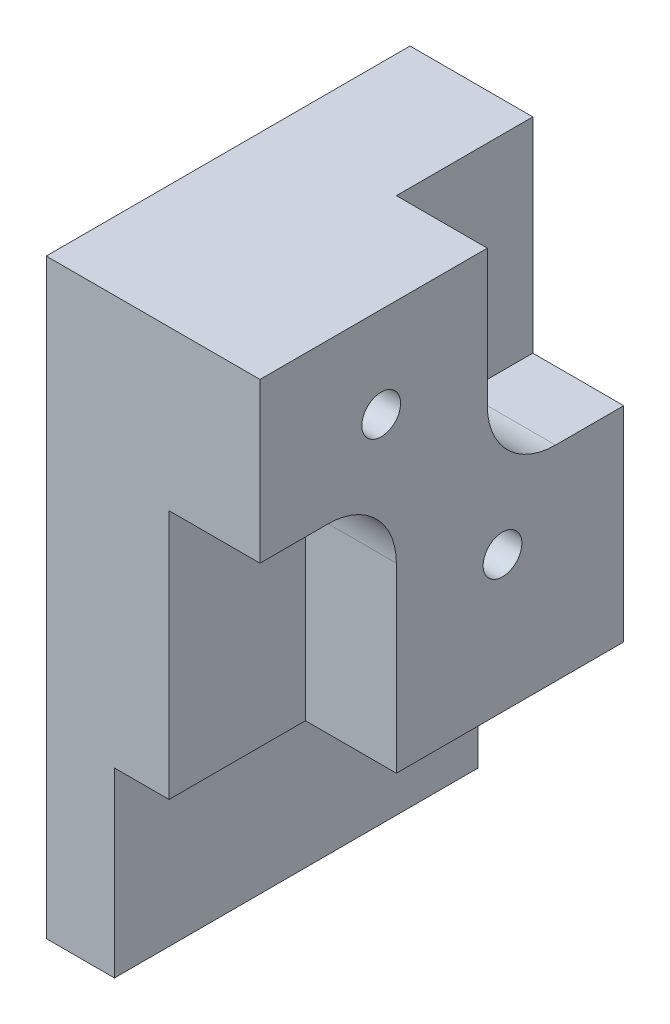
ISO-10303-21;
HEADER;
FILE_DESCRIPTION(('STEP AP214'),'2;1');
FILE_NAME('part.step','',(''),(''),'','','');
FILE_SCHEMA(('AUTOMOTIVE_DESIGN { 1 0 10303 214 1 1 1 1 }'));
ENDSEC;
DATA;
#1=APPLICATION_CONTEXT('core data for automotive mechanical design processes');
#2=APPLICATION_PROTOCOL_DEFINITION('international standard','automotive_design',2000,#1);
#3=PRODUCT_CONTEXT('',#1,'mechanical');
#4=PRODUCT('Part','Part','',(#3));
#5=PRODUCT_RELATED_PRODUCT_CATEGORY('part','',(#4));
#6=PRODUCT_DEFINITION_FORMATION('','',#4);
#7=PRODUCT_DEFINITION_CONTEXT('part definition',#1,'design');
#8=PRODUCT_DEFINITION('design','',#6,#7);
#9=PRODUCT_DEFINITION_SHAPE('','',#8);
#10=(LENGTH_UNIT() NAMED_UNIT(*) SI_UNIT(.MILLI.,.METRE.));
#11=(NAMED_UNIT(*) PLANE_ANGLE_UNIT() SI_UNIT($,.RADIAN.));
#12=(NAMED_UNIT(*) SI_UNIT($,.STERADIAN.) SOLID_ANGLE_UNIT());
#13=UNCERTAINTY_MEASURE_WITH_UNIT(LENGTH_MEASURE(1.E-05),#10,'distance_accuracy_value','');
#14=(GEOMETRIC_REPRESENTATION_CONTEXT(3) GLOBAL_UNCERTAINTY_ASSIGNED_CONTEXT((#13)) GLOBAL_UNIT_ASSIGNED_CONTEXT((#10,
#11,#12)) REPRESENTATION_CONTEXT('',''));
#15=CARTESIAN_POINT('',(0.,0.,0.));
#16=DIRECTION('',(0.,0.,1.));
#17=DIRECTION('',(1.,0.,0.));
#18=AXIS2_PLACEMENT_3D('',#15,#16,#17);
#19=CARTESIAN_POINT('',(-15.2465548990006,0.,25.4));
#20=DIRECTION('',(1.,0.,0.));
#21=DIRECTION('',(0.,1.,0.));
#22=AXIS2_PLACEMENT_3D('',#19,#20,#21);
#23=PLANE('',#22);
#24=CARTESIAN_POINT('',(-15.2465548990006,11.4456023750466,16.9333333333333));
#25=DIRECTION('',(1.,0.,0.));
#26=DIRECTION('',(0.,0.,-1.));
#27=AXIS2_PLACEMENT_3D('',#24,#25,#26);
#28=CIRCLE('',#27,1.35255);
#29=CARTESIAN_POINT('',(-15.2465548990006,11.4456023750466,15.5807833333333));
#30=VERTEX_POINT('',#29);
#31=EDGE_CURVE('E193',#30,#30,#28,.T.);
#32=ORIENTED_EDGE('',*,*,#31,.F.);
#33=EDGE_LOOP('',(#32));
#34=FACE_BOUND('',#33,.T.);
#35=CARTESIAN_POINT('',(-15.2465548990006,-1.25439762495344,8.46666666666667));
#36=DIRECTION('',(1.,0.,0.));
#37=DIRECTION('',(0.,0.,-1.));
#38=AXIS2_PLACEMENT_3D('',#35,#36,#37);
#39=CIRCLE('',#38,1.35255);
#40=CARTESIAN_POINT('',(-15.2465548990006,-1.25439762495344,7.11411666666667));
#41=VERTEX_POINT('',#40);
#42=EDGE_CURVE('E205',#41,#41,#39,.T.);
#43=ORIENTED_EDGE('',*,*,#42,.F.);
#44=EDGE_LOOP('',(#43));
#45=FACE_BOUND('',#44,.T.);
#46=CARTESIAN_POINT('',(-15.2465548990006,8.27060237504656,4.7625));
#47=DIRECTION('',(1.,0.,0.));
#48=DIRECTION('',(0.,1.,0.));
#49=AXIS2_PLACEMENT_3D('',#46,#47,#48);
#50=CIRCLE('',#49,4.7625);
#51=CARTESIAN_POINT('',(-15.2465548990006,8.27060237504656,9.525));
#52=VERTEX_POINT('',#51);
#53=CARTESIAN_POINT('',(-15.2465548990006,3.50810237504656,4.7625));
#54=VERTEX_POINT('',#53);
#55=EDGE_CURVE('E163',#52,#54,#50,.T.);
#56=ORIENTED_EDGE('',*,*,#55,.F.);
#57=DIRECTION('',(0.,1.,0.));
#58=VECTOR('',#57,1.);
#59=CARTESIAN_POINT('',(-15.2465548990006,0.,9.525));
#60=LINE('',#59,#58);
#61=CARTESIAN_POINT('',(-15.2465548990006,17.7956023750466,9.525));
#62=VERTEX_POINT('',#61);
#63=EDGE_CURVE('E141',#52,#62,#60,.T.);
#64=ORIENTED_EDGE('',*,*,#63,.T.);
#65=DIRECTION('',(0.,0.,-1.));
#66=VECTOR('',#65,1.);
#67=CARTESIAN_POINT('',(-15.2465548990006,17.7956023750466,25.4));
#68=LINE('',#67,#66);
#69=CARTESIAN_POINT('',(-15.2465548990006,17.7956023750466,25.4));
#70=VERTEX_POINT('',#69);
#71=EDGE_CURVE('E230',#70,#62,#68,.T.);
#72=ORIENTED_EDGE('',*,*,#71,.F.);
#73=DIRECTION('',(0.,-1.,0.));
#74=VECTOR('',#73,1.);
#75=CARTESIAN_POINT('',(-15.2465548990006,0.,25.4));
#76=LINE('',#75,#74);
#77=CARTESIAN_POINT('',(-15.2465548990006,6.68310237504656,25.4));
#78=VERTEX_POINT('',#77);
#79=EDGE_CURVE('E227',#70,#78,#76,.T.);
#80=ORIENTED_EDGE('',*,*,#79,.T.);
#81=DIRECTION('',(0.,0.,1.));
#82=VECTOR('',#81,1.);
#83=CARTESIAN_POINT('',(-15.2465548990006,6.68310237504656,0.));
#84=LINE('',#83,#82);
#85=CARTESIAN_POINT('',(-15.2465548990006,6.68310237504657,20.6375));
#86=VERTEX_POINT('',#85);
#87=EDGE_CURVE('E187',#86,#78,#84,.T.);
#88=ORIENTED_EDGE('',*,*,#87,.F.);
#89=CARTESIAN_POINT('',(-15.2465548990006,1.92060237504657,20.6375));
#90=DIRECTION('',(1.,0.,0.));
#91=DIRECTION('',(0.,1.,0.));
#92=AXIS2_PLACEMENT_3D('',#89,#90,#91);
#93=CIRCLE('',#92,4.7625);
#94=CARTESIAN_POINT('',(-15.2465548990006,1.92060237504657,15.875));
#95=VERTEX_POINT('',#94);
#96=EDGE_CURVE('E168',#95,#86,#93,.T.);
#97=ORIENTED_EDGE('',*,*,#96,.F.);
#98=DIRECTION('',(0.,-1.,0.));
#99=VECTOR('',#98,1.);
#100=CARTESIAN_POINT('',(-15.2465548990006,0.,15.875));
#101=LINE('',#100,#99);
#102=CARTESIAN_POINT('',(-15.2465548990006,-10.7793976249534,15.875));
#103=VERTEX_POINT('',#102);
#104=EDGE_CURVE('E175',#95,#103,#101,.T.);
#105=ORIENTED_EDGE('',*,*,#104,.T.);
#106=DIRECTION('',(0.,0.,-1.));
#107=VECTOR('',#106,1.);
#108=CARTESIAN_POINT('',(-15.2465548990006,-10.7793976249534,25.4));
#109=LINE('',#108,#107);
#110=CARTESIAN_POINT('',(-15.2465548990006,-10.7793976249534,0.));
#111=VERTEX_POINT('',#110);
#112=EDGE_CURVE('E247',#103,#111,#109,.T.);
#113=ORIENTED_EDGE('',*,*,#112,.T.);
#114=DIRECTION('',(0.,-1.,0.));
#115=VECTOR('',#114,1.);
#116=CARTESIAN_POINT('',(-15.2465548990006,0.,0.));
#117=LINE('',#116,#115);
#118=CARTESIAN_POINT('',(-15.2465548990006,3.50810237504656,0.));
#119=VERTEX_POINT('',#118);
#120=EDGE_CURVE('E216',#119,#111,#117,.T.);
#121=ORIENTED_EDGE('',*,*,#120,.F.);
#122=DIRECTION('',(0.,0.,-1.));
#123=VECTOR('',#122,1.);
#124=CARTESIAN_POINT('',(-15.2465548990006,3.50810237504656,0.));
#125=LINE('',#124,#123);
#126=EDGE_CURVE('E153',#54,#119,#125,.T.);
#127=ORIENTED_EDGE('',*,*,#126,.F.);
#128=EDGE_LOOP('',(#56,#64,#72,#80,#88,#97,#105,#113,#121,#127));
#129=FACE_BOUND('',#128,.T.);
#130=ADVANCED_FACE('F34',(#34,#45,#129),#23,.T.);
#131=CARTESIAN_POINT('',(0.,17.7956023750466,25.4));
#132=DIRECTION('',(0.,1.,0.));
#133=DIRECTION('',(0.,0.,1.));
#134=AXIS2_PLACEMENT_3D('',#131,#132,#133);
#135=PLANE('',#134);
#136=ORIENTED_EDGE('',*,*,#71,.T.);
#137=DIRECTION('',(1.,0.,0.));
#138=VECTOR('',#137,1.);
#139=CARTESIAN_POINT('',(-21.5965548990006,17.7956023750466,9.525));
#140=LINE('',#139,#138);
#141=CARTESIAN_POINT('',(-21.5965548990006,17.7956023750466,9.525));
#142=VERTEX_POINT('',#141);
#143=EDGE_CURVE('E166',#142,#62,#140,.T.);
#144=ORIENTED_EDGE('',*,*,#143,.F.);
#145=DIRECTION('',(0.,0.,1.));
#146=VECTOR('',#145,1.);
#147=CARTESIAN_POINT('',(-21.5965548990006,17.7956023750466,0.));
#148=LINE('',#147,#146);
#149=CARTESIAN_POINT('',(-21.5965548990006,17.7956023750466,0.));
#150=VERTEX_POINT('',#149);
#151=EDGE_CURVE('E147',#150,#142,#148,.T.);
#152=ORIENTED_EDGE('',*,*,#151,.F.);
#153=DIRECTION('',(1.,0.,0.));
#154=VECTOR('',#153,1.);
#155=CARTESIAN_POINT('',(0.,17.7956023750466,0.));
#156=LINE('',#155,#154);
#157=CARTESIAN_POINT('',(-30.1690548990006,17.7956023750466,0.));
#158=VERTEX_POINT('',#157);
#159=EDGE_CURVE('E211',#158,#150,#156,.T.);
#160=ORIENTED_EDGE('',*,*,#159,.F.);
#161=DIRECTION('',(0.,0.,-1.));
#162=VECTOR('',#161,1.);
#163=CARTESIAN_POINT('',(-30.1690548990006,17.7956023750466,25.4));
#164=LINE('',#163,#162);
#165=CARTESIAN_POINT('',(-30.1690548990006,17.7956023750466,25.4));
#166=VERTEX_POINT('',#165);
#167=EDGE_CURVE('E11',#166,#158,#164,.T.);
#168=ORIENTED_EDGE('',*,*,#167,.F.);
#169=DIRECTION('',(1.,0.,0.));
#170=VECTOR('',#169,1.);
#171=CARTESIAN_POINT('',(0.,17.7956023750466,25.4));
#172=LINE('',#171,#170);
#173=EDGE_CURVE('E212',#166,#70,#172,.T.);
#174=ORIENTED_EDGE('',*,*,#173,.T.);
#175=EDGE_LOOP('',(#136,#144,#152,#160,#168,#174));
#176=FACE_BOUND('',#175,.T.);
#177=ADVANCED_FACE('F36',(#176),#135,.T.);
#178=CARTESIAN_POINT('',(0.,-10.7793976249534,25.4));
#179=DIRECTION('',(0.,1.,0.));
#180=DIRECTION('',(0.,0.,1.));
#181=AXIS2_PLACEMENT_3D('',#178,#179,#180);
#182=PLANE('',#181);
#183=DIRECTION('',(1.,0.,0.));
#184=VECTOR('',#183,1.);
#185=CARTESIAN_POINT('',(-21.5965548990006,-10.7793976249534,15.875));
#186=LINE('',#185,#184);
#187=CARTESIAN_POINT('',(-21.5965548990006,-10.7793976249534,15.875));
#188=VERTEX_POINT('',#187);
#189=EDGE_CURVE('E194',#188,#103,#186,.T.);
#190=ORIENTED_EDGE('',*,*,#189,.F.);
#191=DIRECTION('',(0.,0.,-1.));
#192=VECTOR('',#191,1.);
#193=CARTESIAN_POINT('',(-21.5965548990006,-10.7793976249534,0.));
#194=LINE('',#193,#192);
#195=CARTESIAN_POINT('',(-21.5965548990006,-10.7793976249534,25.4));
#196=VERTEX_POINT('',#195);
#197=EDGE_CURVE('E179',#196,#188,#194,.T.);
#198=ORIENTED_EDGE('',*,*,#197,.F.);
#199=DIRECTION('',(1.,0.,0.));
#200=VECTOR('',#199,1.);
#201=CARTESIAN_POINT('',(0.,-10.7793976249534,25.4));
#202=LINE('',#201,#200);
#203=CARTESIAN_POINT('',(-25.4065548990006,-10.7793976249534,25.4));
#204=VERTEX_POINT('',#203);
#205=EDGE_CURVE('E224',#204,#196,#202,.T.);
#206=ORIENTED_EDGE('',*,*,#205,.F.);
#207=DIRECTION('',(0.,0.,-1.));
#208=VECTOR('',#207,1.);
#209=CARTESIAN_POINT('',(-25.4065548990006,-10.7793976249534,25.4));
#210=LINE('',#209,#208);
#211=CARTESIAN_POINT('',(-25.4065548990006,-10.7793976249534,0.));
#212=VERTEX_POINT('',#211);
#213=EDGE_CURVE('E250',#204,#212,#210,.T.);
#214=ORIENTED_EDGE('',*,*,#213,.T.);
#215=DIRECTION('',(1.,0.,0.));
#216=VECTOR('',#215,1.);
#217=CARTESIAN_POINT('',(0.,-10.7793976249534,0.));
#218=LINE('',#217,#216);
#219=EDGE_CURVE('E241',#212,#111,#218,.T.);
#220=ORIENTED_EDGE('',*,*,#219,.T.);
#221=ORIENTED_EDGE('',*,*,#112,.F.);
#222=EDGE_LOOP('',(#190,#198,#206,#214,#220,#221));
#223=FACE_BOUND('',#222,.T.);
#224=ADVANCED_FACE('F275',(#223),#182,.F.);
#225=CARTESIAN_POINT('',(-30.1690548990006,0.,25.4));
#226=DIRECTION('',(-1.,0.,0.));
#227=DIRECTION('',(0.,0.,1.));
#228=AXIS2_PLACEMENT_3D('',#225,#226,#227);
#229=PLANE('',#228);
#230=CARTESIAN_POINT('',(-30.1690548990006,11.4456023750466,16.9333333333333));
#231=DIRECTION('',(1.,0.,0.));
#232=DIRECTION('',(0.,0.,-1.));
#233=AXIS2_PLACEMENT_3D('',#230,#231,#232);
#234=CIRCLE('',#233,1.35255);
#235=CARTESIAN_POINT('',(-30.1690548990006,11.4456023750466,15.5807833333333));
#236=VERTEX_POINT('',#235);
#237=EDGE_CURVE('E202',#236,#236,#234,.T.);
#238=ORIENTED_EDGE('',*,*,#237,.T.);
#239=EDGE_LOOP('',(#238));
#240=FACE_BOUND('',#239,.T.);
#241=CARTESIAN_POINT('',(-30.1690548990006,-1.25439762495344,8.46666666666667));
#242=DIRECTION('',(1.,0.,0.));
#243=DIRECTION('',(0.,0.,-1.));
#244=AXIS2_PLACEMENT_3D('',#241,#242,#243);
#245=CIRCLE('',#244,1.35255);
#246=CARTESIAN_POINT('',(-30.1690548990006,-1.25439762495344,7.11411666666667));
#247=VERTEX_POINT('',#246);
#248=EDGE_CURVE('E208',#247,#247,#245,.T.);
#249=ORIENTED_EDGE('',*,*,#248,.T.);
#250=EDGE_LOOP('',(#249));
#251=FACE_BOUND('',#250,.T.);
#252=DIRECTION('',(0.,1.,0.));
#253=VECTOR('',#252,1.);
#254=CARTESIAN_POINT('',(-30.1690548990006,0.,0.));
#255=LINE('',#254,#253);
#256=CARTESIAN_POINT('',(-30.1690548990006,-23.4793976249534,0.));
#257=VERTEX_POINT('',#256);
#258=EDGE_CURVE('E233',#257,#158,#255,.T.);
#259=ORIENTED_EDGE('',*,*,#258,.F.);
#260=DIRECTION('',(0.,0.,-1.));
#261=VECTOR('',#260,1.);
#262=CARTESIAN_POINT('',(-30.1690548990006,-23.4793976249534,25.4));
#263=LINE('',#262,#261);
#264=CARTESIAN_POINT('',(-30.1690548990006,-23.4793976249534,25.4));
#265=VERTEX_POINT('',#264);
#266=EDGE_CURVE('E42',#265,#257,#263,.T.);
#267=ORIENTED_EDGE('',*,*,#266,.F.);
#268=DIRECTION('',(0.,1.,0.));
#269=VECTOR('',#268,1.);
#270=CARTESIAN_POINT('',(-30.1690548990006,0.,25.4));
#271=LINE('',#270,#269);
#272=EDGE_CURVE('E215',#265,#166,#271,.T.);
#273=ORIENTED_EDGE('',*,*,#272,.T.);
#274=ORIENTED_EDGE('',*,*,#167,.T.);
#275=EDGE_LOOP('',(#259,#267,#273,#274));
#276=FACE_BOUND('',#275,.T.);
#277=ADVANCED_FACE('F261',(#240,#251,#276),#229,.T.);
#278=CARTESIAN_POINT('',(0.,-23.4793976249534,25.4));
#279=DIRECTION('',(0.,-1.,0.));
#280=DIRECTION('',(0.,0.,-1.));
#281=AXIS2_PLACEMENT_3D('',#278,#279,#280);
#282=PLANE('',#281);
#283=DIRECTION('',(-1.,0.,0.));
#284=VECTOR('',#283,1.);
#285=CARTESIAN_POINT('',(0.,-23.4793976249534,0.));
#286=LINE('',#285,#284);
#287=CARTESIAN_POINT('',(-25.4065548990006,-23.4793976249534,0.));
#288=VERTEX_POINT('',#287);
#289=EDGE_CURVE('E236',#288,#257,#286,.T.);
#290=ORIENTED_EDGE('',*,*,#289,.F.);
#291=DIRECTION('',(0.,0.,-1.));
#292=VECTOR('',#291,1.);
#293=CARTESIAN_POINT('',(-25.4065548990006,-23.4793976249534,25.4));
#294=LINE('',#293,#292);
#295=CARTESIAN_POINT('',(-25.4065548990006,-23.4793976249534,25.4));
#296=VERTEX_POINT('',#295);
#297=EDGE_CURVE('E253',#296,#288,#294,.T.);
#298=ORIENTED_EDGE('',*,*,#297,.F.);
#299=DIRECTION('',(-1.,0.,0.));
#300=VECTOR('',#299,1.);
#301=CARTESIAN_POINT('',(0.,-23.4793976249534,25.4));
#302=LINE('',#301,#300);
#303=EDGE_CURVE('E219',#296,#265,#302,.T.);
#304=ORIENTED_EDGE('',*,*,#303,.T.);
#305=ORIENTED_EDGE('',*,*,#266,.T.);
#306=EDGE_LOOP('',(#290,#298,#304,#305));
#307=FACE_BOUND('',#306,.T.);
#308=ADVANCED_FACE('F257',(#307),#282,.T.);
#309=CARTESIAN_POINT('',(-25.4065548990006,0.,25.4));
#310=DIRECTION('',(-1.,0.,0.));
#311=DIRECTION('',(0.,0.,1.));
#312=AXIS2_PLACEMENT_3D('',#309,#310,#311);
#313=PLANE('',#312);
#314=DIRECTION('',(0.,1.,0.));
#315=VECTOR('',#314,1.);
#316=CARTESIAN_POINT('',(-25.4065548990006,0.,0.));
#317=LINE('',#316,#315);
#318=EDGE_CURVE('E239',#288,#212,#317,.T.);
#319=ORIENTED_EDGE('',*,*,#318,.T.);
#320=ORIENTED_EDGE('',*,*,#213,.F.);
#321=DIRECTION('',(0.,1.,0.));
#322=VECTOR('',#321,1.);
#323=CARTESIAN_POINT('',(-25.4065548990006,0.,25.4));
#324=LINE('',#323,#322);
#325=EDGE_CURVE('E222',#296,#204,#324,.T.);
#326=ORIENTED_EDGE('',*,*,#325,.F.);
#327=ORIENTED_EDGE('',*,*,#297,.T.);
#328=EDGE_LOOP('',(#319,#320,#326,#327));
#329=FACE_BOUND('',#328,.T.);
#330=ADVANCED_FACE('F270',(#329),#313,.F.);
#331=CARTESIAN_POINT('',(0.,0.,25.4));
#332=DIRECTION('',(0.,0.,1.));
#333=DIRECTION('',(1.,0.,0.));
#334=AXIS2_PLACEMENT_3D('',#331,#332,#333);
#335=PLANE('',#334);
#336=DIRECTION('',(1.,0.,0.));
#337=VECTOR('',#336,1.);
#338=CARTESIAN_POINT('',(-21.5965548990006,6.68310237504656,25.4));
#339=LINE('',#338,#337);
#340=CARTESIAN_POINT('',(-21.5965548990006,6.68310237504657,25.4));
#341=VERTEX_POINT('',#340);
#342=EDGE_CURVE('E196',#341,#78,#339,.T.);
#343=ORIENTED_EDGE('',*,*,#342,.T.);
#344=ORIENTED_EDGE('',*,*,#79,.F.);
#345=ORIENTED_EDGE('',*,*,#173,.F.);
#346=ORIENTED_EDGE('',*,*,#272,.F.);
#347=ORIENTED_EDGE('',*,*,#303,.F.);
#348=ORIENTED_EDGE('',*,*,#325,.T.);
#349=ORIENTED_EDGE('',*,*,#205,.T.);
#350=DIRECTION('',(0.,-1.,0.));
#351=VECTOR('',#350,1.);
#352=CARTESIAN_POINT('',(-21.5965548990006,0.,25.4));
#353=LINE('',#352,#351);
#354=EDGE_CURVE('E177',#341,#196,#353,.T.);
#355=ORIENTED_EDGE('',*,*,#354,.F.);
#356=EDGE_LOOP('',(#343,#344,#345,#346,#347,#348,#349,#355));
#357=FACE_BOUND('',#356,.T.);
#358=ADVANCED_FACE('F280',(#357),#335,.T.);
#359=CARTESIAN_POINT('',(0.,0.,0.));
#360=DIRECTION('',(0.,0.,1.));
#361=DIRECTION('',(1.,0.,0.));
#362=AXIS2_PLACEMENT_3D('',#359,#360,#361);
#363=PLANE('',#362);
#364=DIRECTION('',(0.,1.,0.));
#365=VECTOR('',#364,1.);
#366=CARTESIAN_POINT('',(-21.5965548990006,0.,0.));
#367=LINE('',#366,#365);
#368=CARTESIAN_POINT('',(-21.5965548990006,3.50810237504656,0.));
#369=VERTEX_POINT('',#368);
#370=EDGE_CURVE('E157',#369,#150,#367,.T.);
#371=ORIENTED_EDGE('',*,*,#370,.F.);
#372=DIRECTION('',(1.,0.,0.));
#373=VECTOR('',#372,1.);
#374=CARTESIAN_POINT('',(-21.5965548990006,3.50810237504656,0.));
#375=LINE('',#374,#373);
#376=EDGE_CURVE('E169',#369,#119,#375,.T.);
#377=ORIENTED_EDGE('',*,*,#376,.T.);
#378=ORIENTED_EDGE('',*,*,#120,.T.);
#379=ORIENTED_EDGE('',*,*,#219,.F.);
#380=ORIENTED_EDGE('',*,*,#318,.F.);
#381=ORIENTED_EDGE('',*,*,#289,.T.);
#382=ORIENTED_EDGE('',*,*,#258,.T.);
#383=ORIENTED_EDGE('',*,*,#159,.T.);
#384=EDGE_LOOP('',(#371,#377,#378,#379,#380,#381,#382,#383));
#385=FACE_BOUND('',#384,.T.);
#386=ADVANCED_FACE('F266',(#385),#363,.F.);
#387=CARTESIAN_POINT('',(-15.2465548990006,-1.25439762495344,8.46666666666667));
#388=DIRECTION('',(1.,0.,0.));
#389=DIRECTION('',(0.,0.,-1.));
#390=AXIS2_PLACEMENT_3D('',#387,#388,#389);
#391=CYLINDRICAL_SURFACE('',#390,1.35255);
#392=ORIENTED_EDGE('',*,*,#248,.F.);
#393=EDGE_LOOP('',(#392));
#394=FACE_BOUND('',#393,.T.);
#395=ORIENTED_EDGE('',*,*,#42,.T.);
#396=EDGE_LOOP('',(#395));
#397=FACE_BOUND('',#396,.T.);
#398=ADVANCED_FACE('F331',(#394,#397),#391,.F.);
#399=CARTESIAN_POINT('',(-15.2465548990006,11.4456023750466,16.9333333333333));
#400=DIRECTION('',(1.,0.,0.));
#401=DIRECTION('',(0.,0.,-1.));
#402=AXIS2_PLACEMENT_3D('',#399,#400,#401);
#403=CYLINDRICAL_SURFACE('',#402,1.35255);
#404=ORIENTED_EDGE('',*,*,#237,.F.);
#405=EDGE_LOOP('',(#404));
#406=FACE_BOUND('',#405,.T.);
#407=ORIENTED_EDGE('',*,*,#31,.T.);
#408=EDGE_LOOP('',(#407));
#409=FACE_BOUND('',#408,.T.);
#410=ADVANCED_FACE('F334',(#406,#409),#403,.F.);
#411=CARTESIAN_POINT('',(-21.5965548990006,1.92060237504657,20.6375));
#412=DIRECTION('',(1.,0.,0.));
#413=DIRECTION('',(0.,1.,0.));
#414=AXIS2_PLACEMENT_3D('',#411,#412,#413);
#415=CYLINDRICAL_SURFACE('',#414,4.7625);
#416=ORIENTED_EDGE('',*,*,#96,.T.);
#417=DIRECTION('',(1.,0.,0.));
#418=VECTOR('',#417,1.);
#419=CARTESIAN_POINT('',(-21.5965548990006,6.68310237504656,20.6375));
#420=LINE('',#419,#418);
#421=CARTESIAN_POINT('',(-21.5965548990006,6.68310237504656,20.6375));
#422=VERTEX_POINT('',#421);
#423=EDGE_CURVE('E184',#422,#86,#420,.T.);
#424=ORIENTED_EDGE('',*,*,#423,.F.);
#425=CARTESIAN_POINT('',(-21.5965548990006,1.92060237504657,20.6375));
#426=DIRECTION('',(1.,0.,0.));
#427=DIRECTION('',(0.,1.,0.));
#428=AXIS2_PLACEMENT_3D('',#425,#426,#427);
#429=CIRCLE('',#428,4.7625);
#430=CARTESIAN_POINT('',(-21.5965548990006,1.92060237504657,15.875));
#431=VERTEX_POINT('',#430);
#432=EDGE_CURVE('E173',#431,#422,#429,.T.);
#433=ORIENTED_EDGE('',*,*,#432,.F.);
#434=DIRECTION('',(1.,0.,0.));
#435=VECTOR('',#434,1.);
#436=CARTESIAN_POINT('',(-21.5965548990006,1.92060237504657,15.875));
#437=LINE('',#436,#435);
#438=EDGE_CURVE('E191',#431,#95,#437,.T.);
#439=ORIENTED_EDGE('',*,*,#438,.T.);
#440=EDGE_LOOP('',(#416,#424,#433,#439));
#441=FACE_BOUND('',#440,.T.);
#442=ADVANCED_FACE('F341',(#441),#415,.F.);
#443=CARTESIAN_POINT('',(-21.5965548990006,0.,15.875));
#444=DIRECTION('',(0.,0.,1.));
#445=DIRECTION('',(1.,0.,0.));
#446=AXIS2_PLACEMENT_3D('',#443,#444,#445);
#447=PLANE('',#446);
#448=ORIENTED_EDGE('',*,*,#104,.F.);
#449=ORIENTED_EDGE('',*,*,#438,.F.);
#450=DIRECTION('',(0.,-1.,0.));
#451=VECTOR('',#450,1.);
#452=CARTESIAN_POINT('',(-21.5965548990006,0.,15.875));
#453=LINE('',#452,#451);
#454=EDGE_CURVE('E182',#431,#188,#453,.T.);
#455=ORIENTED_EDGE('',*,*,#454,.T.);
#456=ORIENTED_EDGE('',*,*,#189,.T.);
#457=EDGE_LOOP('',(#448,#449,#455,#456));
#458=FACE_BOUND('',#457,.T.);
#459=ADVANCED_FACE('F291',(#458),#447,.T.);
#460=CARTESIAN_POINT('',(-21.5965548990006,6.68310237504656,0.));
#461=DIRECTION('',(0.,1.,0.));
#462=DIRECTION('',(-1.,0.,0.));
#463=AXIS2_PLACEMENT_3D('',#460,#461,#462);
#464=PLANE('',#463);
#465=ORIENTED_EDGE('',*,*,#87,.T.);
#466=ORIENTED_EDGE('',*,*,#342,.F.);
#467=DIRECTION('',(0.,0.,1.));
#468=VECTOR('',#467,1.);
#469=CARTESIAN_POINT('',(-21.5965548990006,6.68310237504656,0.));
#470=LINE('',#469,#468);
#471=EDGE_CURVE('E57',#422,#341,#470,.T.);
#472=ORIENTED_EDGE('',*,*,#471,.F.);
#473=ORIENTED_EDGE('',*,*,#423,.T.);
#474=EDGE_LOOP('',(#465,#466,#472,#473));
#475=FACE_BOUND('',#474,.T.);
#476=ADVANCED_FACE('F296',(#475),#464,.F.);
#477=CARTESIAN_POINT('',(-21.5965548990006,0.,0.));
#478=DIRECTION('',(1.,0.,0.));
#479=DIRECTION('',(0.,1.,0.));
#480=AXIS2_PLACEMENT_3D('',#477,#478,#479);
#481=PLANE('',#480);
#482=ORIENTED_EDGE('',*,*,#432,.T.);
#483=ORIENTED_EDGE('',*,*,#471,.T.);
#484=ORIENTED_EDGE('',*,*,#354,.T.);
#485=ORIENTED_EDGE('',*,*,#197,.T.);
#486=ORIENTED_EDGE('',*,*,#454,.F.);
#487=EDGE_LOOP('',(#482,#483,#484,#485,#486));
#488=FACE_BOUND('',#487,.T.);
#489=ADVANCED_FACE('F294',(#488),#481,.T.);
#490=CARTESIAN_POINT('',(-21.5965548990006,0.,9.525));
#491=DIRECTION('',(0.,0.,-1.));
#492=DIRECTION('',(-1.,0.,0.));
#493=AXIS2_PLACEMENT_3D('',#490,#491,#492);
#494=PLANE('',#493);
#495=ORIENTED_EDGE('',*,*,#63,.F.);
#496=DIRECTION('',(1.,0.,0.));
#497=VECTOR('',#496,1.);
#498=CARTESIAN_POINT('',(-21.5965548990006,8.27060237504656,9.525));
#499=LINE('',#498,#497);
#500=CARTESIAN_POINT('',(-21.5965548990006,8.27060237504656,9.525));
#501=VERTEX_POINT('',#500);
#502=EDGE_CURVE('E135',#501,#52,#499,.T.);
#503=ORIENTED_EDGE('',*,*,#502,.F.);
#504=DIRECTION('',(0.,1.,0.));
#505=VECTOR('',#504,1.);
#506=CARTESIAN_POINT('',(-21.5965548990006,0.,9.525));
#507=LINE('',#506,#505);
#508=EDGE_CURVE('E138',#501,#142,#507,.T.);
#509=ORIENTED_EDGE('',*,*,#508,.T.);
#510=ORIENTED_EDGE('',*,*,#143,.T.);
#511=EDGE_LOOP('',(#495,#503,#509,#510));
#512=FACE_BOUND('',#511,.T.);
#513=ADVANCED_FACE('F137',(#512),#494,.T.);
#514=CARTESIAN_POINT('',(-21.5965548990006,3.50810237504656,0.));
#515=DIRECTION('',(0.,-1.,0.));
#516=DIRECTION('',(0.,0.,-1.));
#517=AXIS2_PLACEMENT_3D('',#514,#515,#516);
#518=PLANE('',#517);
#519=ORIENTED_EDGE('',*,*,#126,.T.);
#520=ORIENTED_EDGE('',*,*,#376,.F.);
#521=DIRECTION('',(0.,0.,-1.));
#522=VECTOR('',#521,1.);
#523=CARTESIAN_POINT('',(-21.5965548990006,3.50810237504656,0.));
#524=LINE('',#523,#522);
#525=CARTESIAN_POINT('',(-21.5965548990006,3.50810237504656,4.7625));
#526=VERTEX_POINT('',#525);
#527=EDGE_CURVE('E49',#526,#369,#524,.T.);
#528=ORIENTED_EDGE('',*,*,#527,.F.);
#529=DIRECTION('',(1.,0.,0.));
#530=VECTOR('',#529,1.);
#531=CARTESIAN_POINT('',(-21.5965548990006,3.50810237504656,4.7625));
#532=LINE('',#531,#530);
#533=EDGE_CURVE('E146',#526,#54,#532,.T.);
#534=ORIENTED_EDGE('',*,*,#533,.T.);
#535=EDGE_LOOP('',(#519,#520,#528,#534));
#536=FACE_BOUND('',#535,.T.);
#537=ADVANCED_FACE('F302',(#536),#518,.F.);
#538=CARTESIAN_POINT('',(-21.5965548990006,8.27060237504656,4.7625));
#539=DIRECTION('',(1.,0.,0.));
#540=DIRECTION('',(0.,1.,0.));
#541=AXIS2_PLACEMENT_3D('',#538,#539,#540);
#542=CYLINDRICAL_SURFACE('',#541,4.7625);
#543=ORIENTED_EDGE('',*,*,#55,.T.);
#544=ORIENTED_EDGE('',*,*,#533,.F.);
#545=CARTESIAN_POINT('',(-21.5965548990006,8.27060237504656,4.7625));
#546=DIRECTION('',(1.,0.,0.));
#547=DIRECTION('',(0.,1.,0.));
#548=AXIS2_PLACEMENT_3D('',#545,#546,#547);
#549=CIRCLE('',#548,4.7625);
#550=EDGE_CURVE('E150',#501,#526,#549,.T.);
#551=ORIENTED_EDGE('',*,*,#550,.F.);
#552=ORIENTED_EDGE('',*,*,#502,.T.);
#553=EDGE_LOOP('',(#543,#544,#551,#552));
#554=FACE_BOUND('',#553,.T.);
#555=ADVANCED_FACE('F155',(#554),#542,.F.);
#556=CARTESIAN_POINT('',(-21.5965548990006,0.,0.));
#557=DIRECTION('',(1.,0.,0.));
#558=DIRECTION('',(0.,1.,0.));
#559=AXIS2_PLACEMENT_3D('',#556,#557,#558);
#560=PLANE('',#559);
#561=ORIENTED_EDGE('',*,*,#508,.F.);
#562=ORIENTED_EDGE('',*,*,#550,.T.);
#563=ORIENTED_EDGE('',*,*,#527,.T.);
#564=ORIENTED_EDGE('',*,*,#370,.T.);
#565=ORIENTED_EDGE('',*,*,#151,.T.);
#566=EDGE_LOOP('',(#561,#562,#563,#564,#565));
#567=FACE_BOUND('',#566,.T.);
#568=ADVANCED_FACE('F149',(#567),#560,.T.);
#569=CLOSED_SHELL('',(#130,#177,#224,#277,#308,#330,#358,#386,#398,#410,#442,#459,#476,#489,
#513,#537,#555,#568));
#570=MANIFOLD_SOLID_BREP('B2',#569);
#571=ADVANCED_BREP_SHAPE_REPRESENTATION('',(#18,#570),#14);
#572=SHAPE_DEFINITION_REPRESENTATION(#9,#571);
ENDSEC;
END-ISO-10303-21;
